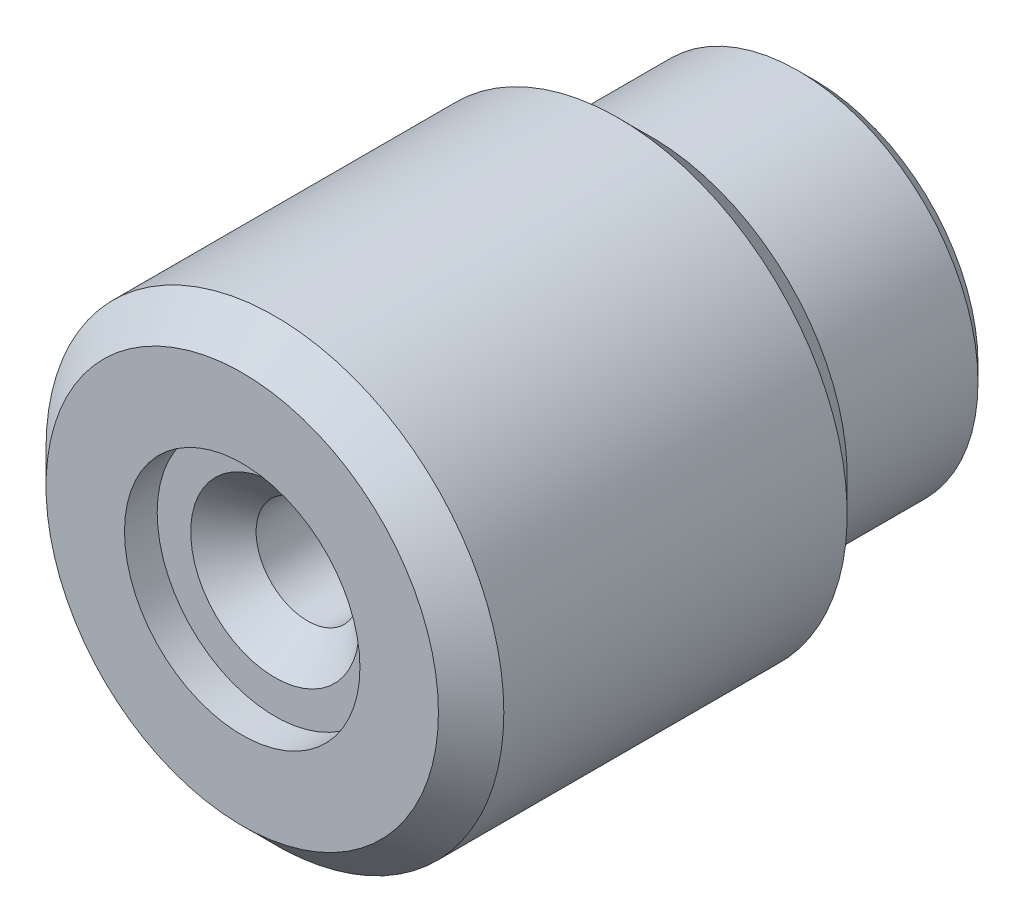
ISO-10303-21;
HEADER;
FILE_DESCRIPTION(('STEP AP214'),'2;1');
FILE_NAME('part.step','',(''),(''),'','','');
FILE_SCHEMA(('AUTOMOTIVE_DESIGN { 1 0 10303 214 1 1 1 1 }'));
ENDSEC;
DATA;
#1=APPLICATION_CONTEXT('core data for automotive mechanical design processes');
#2=APPLICATION_PROTOCOL_DEFINITION('international standard','automotive_design',2000,#1);
#3=PRODUCT_CONTEXT('',#1,'mechanical');
#4=PRODUCT('Part','Part','',(#3));
#5=PRODUCT_RELATED_PRODUCT_CATEGORY('part','',(#4));
#6=PRODUCT_DEFINITION_FORMATION('','',#4);
#7=PRODUCT_DEFINITION_CONTEXT('part definition',#1,'design');
#8=PRODUCT_DEFINITION('design','',#6,#7);
#9=PRODUCT_DEFINITION_SHAPE('','',#8);
#10=(LENGTH_UNIT() NAMED_UNIT(*) SI_UNIT(.MILLI.,.METRE.));
#11=(NAMED_UNIT(*) PLANE_ANGLE_UNIT() SI_UNIT($,.RADIAN.));
#12=(NAMED_UNIT(*) SI_UNIT($,.STERADIAN.) SOLID_ANGLE_UNIT());
#13=UNCERTAINTY_MEASURE_WITH_UNIT(LENGTH_MEASURE(1.E-05),#10,'distance_accuracy_value','');
#14=(GEOMETRIC_REPRESENTATION_CONTEXT(3) GLOBAL_UNCERTAINTY_ASSIGNED_CONTEXT((#13)) GLOBAL_UNIT_ASSIGNED_CONTEXT((#10,
#11,#12)) REPRESENTATION_CONTEXT('',''));
#15=CARTESIAN_POINT('',(0.,0.,0.));
#16=DIRECTION('',(0.,0.,1.));
#17=DIRECTION('',(1.,0.,0.));
#18=AXIS2_PLACEMENT_3D('',#15,#16,#17);
#19=CARTESIAN_POINT('',(3.84063472307616,-1.11752669232601,-5.71241945763342));
#20=DIRECTION('',(0.,0.,1.));
#21=DIRECTION('',(1.,0.,0.));
#22=AXIS2_PLACEMENT_3D('',#19,#20,#21);
#23=CYLINDRICAL_SURFACE('',#22,0.8);
#24=CARTESIAN_POINT('',(3.84063472307616,-1.11752669232601,2.16158054236658));
#25=DIRECTION('',(0.,0.,1.));
#26=DIRECTION('',(1.,0.,0.));
#27=AXIS2_PLACEMENT_3D('',#24,#25,#26);
#28=CIRCLE('',#27,0.8);
#29=CARTESIAN_POINT('',(4.64063472307616,-1.11752669232601,2.16158054236658));
#30=VERTEX_POINT('',#29);
#31=EDGE_CURVE('E44',#30,#30,#28,.T.);
#32=ORIENTED_EDGE('',*,*,#31,.T.);
#33=EDGE_LOOP('',(#32));
#34=FACE_BOUND('',#33,.T.);
#35=CARTESIAN_POINT('',(3.84063472307616,-1.11752669232601,-1.90241945763342));
#36=DIRECTION('',(0.,0.,-1.));
#37=DIRECTION('',(-1.,0.,0.));
#38=AXIS2_PLACEMENT_3D('',#35,#36,#37);
#39=CIRCLE('',#38,0.8);
#40=CARTESIAN_POINT('',(3.04063472307616,-1.11752669232601,-1.90241945763342));
#41=VERTEX_POINT('',#40);
#42=EDGE_CURVE('E51',#41,#41,#39,.T.);
#43=ORIENTED_EDGE('',*,*,#42,.T.);
#44=EDGE_LOOP('',(#43));
#45=FACE_BOUND('',#44,.T.);
#46=ADVANCED_FACE('F12',(#34,#45),#23,.F.);
#47=CARTESIAN_POINT('',(3.84063472307616,-1.11752669232601,3.17758054236658));
#48=DIRECTION('',(0.,0.,-1.));
#49=DIRECTION('',(-1.,0.,0.));
#50=AXIS2_PLACEMENT_3D('',#47,#48,#49);
#51=CYLINDRICAL_SURFACE('',#50,3.556);
#52=CARTESIAN_POINT('',(3.84063472307616,-1.11752669232601,-2.66441945763342));
#53=DIRECTION('',(0.,0.,-1.));
#54=DIRECTION('',(-1.,0.,0.));
#55=AXIS2_PLACEMENT_3D('',#52,#53,#54);
#56=CIRCLE('',#55,3.556);
#57=CARTESIAN_POINT('',(0.284634723076164,-1.11752669232601,-2.66441945763342));
#58=VERTEX_POINT('',#57);
#59=EDGE_CURVE('E35',#58,#58,#56,.F.);
#60=ORIENTED_EDGE('',*,*,#59,.T.);
#61=EDGE_LOOP('',(#60));
#62=FACE_BOUND('',#61,.T.);
#63=CARTESIAN_POINT('',(3.84063472307616,-1.11752669232601,2.66958054236658));
#64=DIRECTION('',(0.,0.,1.));
#65=DIRECTION('',(1.,0.,0.));
#66=AXIS2_PLACEMENT_3D('',#63,#64,#65);
#67=CIRCLE('',#66,3.556);
#68=CARTESIAN_POINT('',(7.39663472307616,-1.11752669232601,2.66958054236658));
#69=VERTEX_POINT('',#68);
#70=EDGE_CURVE('E38',#69,#69,#67,.F.);
#71=ORIENTED_EDGE('',*,*,#70,.T.);
#72=EDGE_LOOP('',(#71));
#73=FACE_BOUND('',#72,.T.);
#74=ADVANCED_FACE('F78',(#62,#73),#51,.T.);
#75=CARTESIAN_POINT('',(3.84063472307616,-1.11752669232601,3.17758054236658));
#76=DIRECTION('',(0.,0.,1.));
#77=DIRECTION('',(1.,0.,0.));
#78=AXIS2_PLACEMENT_3D('',#75,#76,#77);
#79=PLANE('',#78);
#80=CARTESIAN_POINT('',(3.84063472307616,-1.11752669232601,3.17758054236658));
#81=DIRECTION('',(0.,0.,1.));
#82=DIRECTION('',(1.,0.,0.));
#83=AXIS2_PLACEMENT_3D('',#80,#81,#82);
#84=CIRCLE('',#83,3.048);
#85=CARTESIAN_POINT('',(6.88863472307617,-1.11752669232601,3.17758054236658));
#86=VERTEX_POINT('',#85);
#87=EDGE_CURVE('E32',#86,#86,#84,.T.);
#88=ORIENTED_EDGE('',*,*,#87,.T.);
#89=EDGE_LOOP('',(#88));
#90=FACE_BOUND('',#89,.T.);
#91=CARTESIAN_POINT('',(3.84063472307616,-1.11752669232601,3.17758054236658));
#92=DIRECTION('',(0.,0.,1.));
#93=DIRECTION('',(1.,0.,0.));
#94=AXIS2_PLACEMENT_3D('',#91,#92,#93);
#95=CIRCLE('',#94,1.8288);
#96=CARTESIAN_POINT('',(5.66943472307616,-1.11752669232601,3.17758054236658));
#97=VERTEX_POINT('',#96);
#98=EDGE_CURVE('E60',#97,#97,#95,.T.);
#99=ORIENTED_EDGE('',*,*,#98,.F.);
#100=EDGE_LOOP('',(#99));
#101=FACE_BOUND('',#100,.T.);
#102=ADVANCED_FACE('F75',(#90,#101),#79,.T.);
#103=CARTESIAN_POINT('',(3.84063472307616,-1.11752669232601,-3.17241945763342));
#104=DIRECTION('',(0.,0.,-1.));
#105=DIRECTION('',(-1.,0.,0.));
#106=AXIS2_PLACEMENT_3D('',#103,#104,#105);
#107=PLANE('',#106);
#108=CARTESIAN_POINT('',(3.84063472307616,-1.11752669232601,-3.17241945763342));
#109=DIRECTION('',(0.,0.,-1.));
#110=DIRECTION('',(-1.,0.,0.));
#111=AXIS2_PLACEMENT_3D('',#108,#109,#110);
#112=CIRCLE('',#111,3.048);
#113=CARTESIAN_POINT('',(0.792634723076163,-1.11752669232601,-3.17241945763342));
#114=VERTEX_POINT('',#113);
#115=EDGE_CURVE('E41',#114,#114,#112,.T.);
#116=ORIENTED_EDGE('',*,*,#115,.T.);
#117=EDGE_LOOP('',(#116));
#118=FACE_BOUND('',#117,.T.);
#119=CARTESIAN_POINT('',(3.84063472307616,-1.11752669232601,-3.17241945763342));
#120=DIRECTION('',(0.,0.,-1.));
#121=DIRECTION('',(-1.,0.,0.));
#122=AXIS2_PLACEMENT_3D('',#119,#120,#121);
#123=CIRCLE('',#122,2.794);
#124=CARTESIAN_POINT('',(1.04663472307616,-1.11752669232601,-3.17241945763342));
#125=VERTEX_POINT('',#124);
#126=EDGE_CURVE('E50',#125,#125,#123,.T.);
#127=ORIENTED_EDGE('',*,*,#126,.F.);
#128=EDGE_LOOP('',(#127));
#129=FACE_BOUND('',#128,.T.);
#130=ADVANCED_FACE('F77',(#118,#129),#107,.T.);
#131=CARTESIAN_POINT('',(3.84063472307616,-1.11752669232601,-3.17241945763342));
#132=DIRECTION('',(0.,0.,-1.));
#133=DIRECTION('',(-1.,0.,0.));
#134=AXIS2_PLACEMENT_3D('',#131,#132,#133);
#135=CYLINDRICAL_SURFACE('',#134,2.794);
#136=CARTESIAN_POINT('',(3.84063472307616,-1.11752669232601,-5.45841945763342));
#137=DIRECTION('',(0.,0.,1.));
#138=DIRECTION('',(1.,0.,0.));
#139=AXIS2_PLACEMENT_3D('',#136,#137,#138);
#140=CIRCLE('',#139,2.794);
#141=CARTESIAN_POINT('',(6.63463472307616,-1.11752669232601,-5.45841945763342));
#142=VERTEX_POINT('',#141);
#143=EDGE_CURVE('E8',#142,#142,#140,.T.);
#144=ORIENTED_EDGE('',*,*,#143,.T.);
#145=EDGE_LOOP('',(#144));
#146=FACE_BOUND('',#145,.T.);
#147=ORIENTED_EDGE('',*,*,#126,.T.);
#148=EDGE_LOOP('',(#147));
#149=FACE_BOUND('',#148,.T.);
#150=ADVANCED_FACE('F86',(#146,#149),#135,.T.);
#151=CARTESIAN_POINT('',(3.84063472307616,-1.11752669232601,-5.71241945763342));
#152=DIRECTION('',(0.,0.,1.));
#153=DIRECTION('',(1.,0.,0.));
#154=AXIS2_PLACEMENT_3D('',#151,#152,#153);
#155=PLANE('',#154);
#156=CARTESIAN_POINT('',(3.84063472307616,-1.11752669232601,-5.71241945763342));
#157=DIRECTION('',(0.,0.,1.));
#158=DIRECTION('',(1.,0.,0.));
#159=AXIS2_PLACEMENT_3D('',#156,#157,#158);
#160=CIRCLE('',#159,1.11400000000001);
#161=CARTESIAN_POINT('',(4.95463472307617,-1.11752669232601,-5.71241945763342));
#162=VERTEX_POINT('',#161);
#163=EDGE_CURVE('E19',#162,#162,#160,.T.);
#164=ORIENTED_EDGE('',*,*,#163,.T.);
#165=EDGE_LOOP('',(#164));
#166=FACE_BOUND('',#165,.T.);
#167=CARTESIAN_POINT('',(3.84063472307616,-1.11752669232601,-5.71241945763342));
#168=DIRECTION('',(0.,0.,1.));
#169=DIRECTION('',(1.,0.,0.));
#170=AXIS2_PLACEMENT_3D('',#167,#168,#169);
#171=CIRCLE('',#170,2.54);
#172=CARTESIAN_POINT('',(6.38063472307617,-1.11752669232601,-5.71241945763342));
#173=VERTEX_POINT('',#172);
#174=EDGE_CURVE('E23',#173,#173,#171,.F.);
#175=ORIENTED_EDGE('',*,*,#174,.T.);
#176=EDGE_LOOP('',(#175));
#177=FACE_BOUND('',#176,.T.);
#178=ADVANCED_FACE('F107',(#166,#177),#155,.F.);
#179=CARTESIAN_POINT('',(3.84063472307616,-1.11752669232601,-1.90241945763342));
#180=DIRECTION('',(0.,0.,-1.));
#181=DIRECTION('',(-1.,0.,0.));
#182=AXIS2_PLACEMENT_3D('',#179,#180,#181);
#183=CYLINDRICAL_SURFACE('',#182,0.86);
#184=CARTESIAN_POINT('',(3.84063472307616,-1.11752669232601,-5.45841945763341));
#185=DIRECTION('',(0.,0.,1.));
#186=DIRECTION('',(1.,0.,0.));
#187=AXIS2_PLACEMENT_3D('',#184,#185,#186);
#188=CIRCLE('',#187,0.86);
#189=CARTESIAN_POINT('',(4.70063472307616,-1.11752669232601,-5.45841945763341));
#190=VERTEX_POINT('',#189);
#191=EDGE_CURVE('E27',#190,#190,#188,.F.);
#192=ORIENTED_EDGE('',*,*,#191,.T.);
#193=EDGE_LOOP('',(#192));
#194=FACE_BOUND('',#193,.T.);
#195=CARTESIAN_POINT('',(3.84063472307616,-1.11752669232601,-1.90241945763342));
#196=DIRECTION('',(0.,0.,-1.));
#197=DIRECTION('',(-1.,0.,0.));
#198=AXIS2_PLACEMENT_3D('',#195,#196,#197);
#199=CIRCLE('',#198,0.86);
#200=CARTESIAN_POINT('',(2.98063472307616,-1.11752669232601,-1.90241945763342));
#201=VERTEX_POINT('',#200);
#202=EDGE_CURVE('E54',#201,#201,#199,.T.);
#203=ORIENTED_EDGE('',*,*,#202,.F.);
#204=EDGE_LOOP('',(#203));
#205=FACE_BOUND('',#204,.T.);
#206=ADVANCED_FACE('F103',(#194,#205),#183,.F.);
#207=CARTESIAN_POINT('',(3.84063472307616,-1.11752669232601,-1.90241945763342));
#208=DIRECTION('',(0.,0.,-1.));
#209=DIRECTION('',(-1.,0.,0.));
#210=AXIS2_PLACEMENT_3D('',#207,#208,#209);
#211=PLANE('',#210);
#212=ORIENTED_EDGE('',*,*,#42,.F.);
#213=EDGE_LOOP('',(#212));
#214=FACE_BOUND('',#213,.T.);
#215=ORIENTED_EDGE('',*,*,#202,.T.);
#216=EDGE_LOOP('',(#215));
#217=FACE_BOUND('',#216,.T.);
#218=ADVANCED_FACE('F100',(#214,#217),#211,.T.);
#219=CARTESIAN_POINT('',(3.84063472307616,-1.11752669232601,2.66958054236658));
#220=DIRECTION('',(0.,0.,1.));
#221=DIRECTION('',(1.,0.,0.));
#222=AXIS2_PLACEMENT_3D('',#219,#220,#221);
#223=PLANE('',#222);
#224=CARTESIAN_POINT('',(3.84063472307616,-1.11752669232601,2.66958054236658));
#225=DIRECTION('',(0.,0.,1.));
#226=DIRECTION('',(1.,0.,0.));
#227=AXIS2_PLACEMENT_3D('',#224,#225,#226);
#228=CIRCLE('',#227,1.308);
#229=CARTESIAN_POINT('',(5.14863472307616,-1.11752669232601,2.66958054236658));
#230=VERTEX_POINT('',#229);
#231=EDGE_CURVE('E47',#230,#230,#228,.F.);
#232=ORIENTED_EDGE('',*,*,#231,.T.);
#233=EDGE_LOOP('',(#232));
#234=FACE_BOUND('',#233,.T.);
#235=CARTESIAN_POINT('',(3.84063472307616,-1.11752669232601,2.66958054236658));
#236=DIRECTION('',(0.,0.,1.));
#237=DIRECTION('',(1.,0.,0.));
#238=AXIS2_PLACEMENT_3D('',#235,#236,#237);
#239=CIRCLE('',#238,1.8288);
#240=CARTESIAN_POINT('',(5.66943472307616,-1.11752669232601,2.66958054236658));
#241=VERTEX_POINT('',#240);
#242=EDGE_CURVE('E55',#241,#241,#239,.T.);
#243=ORIENTED_EDGE('',*,*,#242,.T.);
#244=EDGE_LOOP('',(#243));
#245=FACE_BOUND('',#244,.T.);
#246=ADVANCED_FACE('F66',(#234,#245),#223,.T.);
#247=CARTESIAN_POINT('',(3.84063472307616,-1.11752669232601,2.66958054236658));
#248=DIRECTION('',(0.,0.,1.));
#249=DIRECTION('',(1.,0.,0.));
#250=AXIS2_PLACEMENT_3D('',#247,#248,#249);
#251=CYLINDRICAL_SURFACE('',#250,1.8288);
#252=ORIENTED_EDGE('',*,*,#242,.F.);
#253=EDGE_LOOP('',(#252));
#254=FACE_BOUND('',#253,.T.);
#255=ORIENTED_EDGE('',*,*,#98,.T.);
#256=EDGE_LOOP('',(#255));
#257=FACE_BOUND('',#256,.T.);
#258=ADVANCED_FACE('F68',(#254,#257),#251,.F.);
#259=CARTESIAN_POINT('',(3.84063472307616,-1.11752669232601,2.66958054236658));
#260=DIRECTION('',(0.,0.,1.));
#261=DIRECTION('',(1.,0.,0.));
#262=AXIS2_PLACEMENT_3D('',#259,#260,#261);
#263=CONICAL_SURFACE('',#262,1.308,0.785398163397445);
#264=ORIENTED_EDGE('',*,*,#31,.F.);
#265=EDGE_LOOP('',(#264));
#266=FACE_BOUND('',#265,.T.);
#267=ORIENTED_EDGE('',*,*,#231,.F.);
#268=EDGE_LOOP('',(#267));
#269=FACE_BOUND('',#268,.T.);
#270=ADVANCED_FACE('F71',(#266,#269),#263,.F.);
#271=CARTESIAN_POINT('',(3.84063472307616,-1.11752669232601,-3.17241945763342));
#272=DIRECTION('',(0.,0.,1.));
#273=DIRECTION('',(1.,0.,0.));
#274=AXIS2_PLACEMENT_3D('',#271,#272,#273);
#275=CONICAL_SURFACE('',#274,3.048,0.785398163397447);
#276=ORIENTED_EDGE('',*,*,#59,.F.);
#277=EDGE_LOOP('',(#276));
#278=FACE_BOUND('',#277,.T.);
#279=ORIENTED_EDGE('',*,*,#115,.F.);
#280=EDGE_LOOP('',(#279));
#281=FACE_BOUND('',#280,.T.);
#282=ADVANCED_FACE('F123',(#278,#281),#275,.T.);
#283=CARTESIAN_POINT('',(3.84063472307616,-1.11752669232601,3.17758054236658));
#284=DIRECTION('',(0.,0.,-1.));
#285=DIRECTION('',(-1.,0.,0.));
#286=AXIS2_PLACEMENT_3D('',#283,#284,#285);
#287=CONICAL_SURFACE('',#286,3.048,0.785398163397447);
#288=ORIENTED_EDGE('',*,*,#70,.F.);
#289=EDGE_LOOP('',(#288));
#290=FACE_BOUND('',#289,.T.);
#291=ORIENTED_EDGE('',*,*,#87,.F.);
#292=EDGE_LOOP('',(#291));
#293=FACE_BOUND('',#292,.T.);
#294=ADVANCED_FACE('F127',(#290,#293),#287,.T.);
#295=CARTESIAN_POINT('',(3.84063472307616,-1.11752669232601,-5.45841945763341));
#296=DIRECTION('',(0.,0.,-1.));
#297=DIRECTION('',(-1.,0.,0.));
#298=AXIS2_PLACEMENT_3D('',#295,#296,#297);
#299=CONICAL_SURFACE('',#298,0.86,0.78539816339745);
#300=ORIENTED_EDGE('',*,*,#163,.F.);
#301=EDGE_LOOP('',(#300));
#302=FACE_BOUND('',#301,.T.);
#303=ORIENTED_EDGE('',*,*,#191,.F.);
#304=EDGE_LOOP('',(#303));
#305=FACE_BOUND('',#304,.T.);
#306=ADVANCED_FACE('F130',(#302,#305),#299,.F.);
#307=CARTESIAN_POINT('',(3.84063472307616,-1.11752669232601,-5.71241945763342));
#308=DIRECTION('',(0.,0.,1.));
#309=DIRECTION('',(1.,0.,0.));
#310=AXIS2_PLACEMENT_3D('',#307,#308,#309);
#311=CONICAL_SURFACE('',#310,2.54,0.785398163397449);
#312=ORIENTED_EDGE('',*,*,#143,.F.);
#313=EDGE_LOOP('',(#312));
#314=FACE_BOUND('',#313,.T.);
#315=ORIENTED_EDGE('',*,*,#174,.F.);
#316=EDGE_LOOP('',(#315));
#317=FACE_BOUND('',#316,.T.);
#318=ADVANCED_FACE('F14',(#314,#317),#311,.T.);
#319=CLOSED_SHELL('',(#46,#74,#102,#130,#150,#178,#206,#218,#246,#258,#270,#282,#294,#306,#318));
#320=MANIFOLD_SOLID_BREP('B1',#319);
#321=ADVANCED_BREP_SHAPE_REPRESENTATION('',(#18,#320),#14);
#322=SHAPE_DEFINITION_REPRESENTATION(#9,#321);
ENDSEC;
END-ISO-10303-21;
